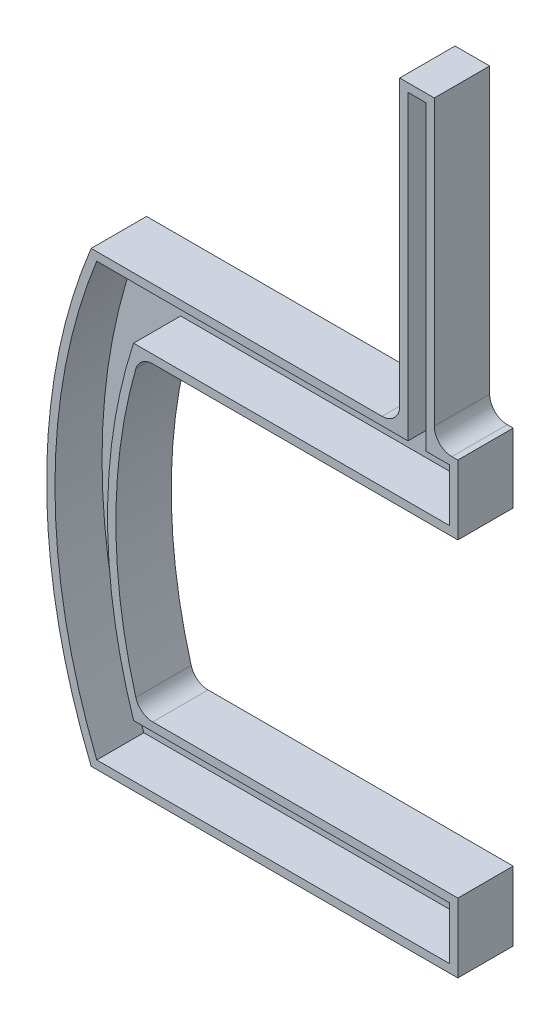
ISO-10303-21;
HEADER;
FILE_DESCRIPTION(('STEP AP214'),'2;1');
FILE_NAME('part.step','',(''),(''),'','','');
FILE_SCHEMA(('AUTOMOTIVE_DESIGN { 1 0 10303 214 1 1 1 1 }'));
ENDSEC;
DATA;
#1=APPLICATION_CONTEXT('core data for automotive mechanical design processes');
#2=APPLICATION_PROTOCOL_DEFINITION('international standard','automotive_design',2000,#1);
#3=PRODUCT_CONTEXT('',#1,'mechanical');
#4=PRODUCT('Part','Part','',(#3));
#5=PRODUCT_RELATED_PRODUCT_CATEGORY('part','',(#4));
#6=PRODUCT_DEFINITION_FORMATION('','',#4);
#7=PRODUCT_DEFINITION_CONTEXT('part definition',#1,'design');
#8=PRODUCT_DEFINITION('design','',#6,#7);
#9=PRODUCT_DEFINITION_SHAPE('','',#8);
#10=(LENGTH_UNIT() NAMED_UNIT(*) SI_UNIT(.MILLI.,.METRE.));
#11=(NAMED_UNIT(*) PLANE_ANGLE_UNIT() SI_UNIT($,.RADIAN.));
#12=(NAMED_UNIT(*) SI_UNIT($,.STERADIAN.) SOLID_ANGLE_UNIT());
#13=UNCERTAINTY_MEASURE_WITH_UNIT(LENGTH_MEASURE(1.E-05),#10,'distance_accuracy_value','');
#14=(GEOMETRIC_REPRESENTATION_CONTEXT(3) GLOBAL_UNCERTAINTY_ASSIGNED_CONTEXT((#13)) GLOBAL_UNIT_ASSIGNED_CONTEXT((#10,
#11,#12)) REPRESENTATION_CONTEXT('',''));
#15=CARTESIAN_POINT('',(0.,0.,0.));
#16=DIRECTION('',(0.,0.,1.));
#17=DIRECTION('',(1.,0.,0.));
#18=AXIS2_PLACEMENT_3D('',#15,#16,#17);
#19=CARTESIAN_POINT('',(-72.,81.,20.));
#20=DIRECTION('',(0.,-1.,0.));
#21=DIRECTION('',(0.,0.,-1.));
#22=AXIS2_PLACEMENT_3D('',#19,#20,#21);
#23=PLANE('',#22);
#24=DIRECTION('',(-1.,0.,0.));
#25=VECTOR('',#24,1.);
#26=CARTESIAN_POINT('',(-72.,81.,0.));
#27=LINE('',#26,#25);
#28=CARTESIAN_POINT('',(-63.5,81.,0.));
#29=VERTEX_POINT('',#28);
#30=CARTESIAN_POINT('',(-65.65,81.,0.));
#31=VERTEX_POINT('',#30);
#32=EDGE_CURVE('E294',#29,#31,#27,.T.);
#33=ORIENTED_EDGE('',*,*,#32,.T.);
#34=DIRECTION('',(0.,0.,-1.));
#35=VECTOR('',#34,1.);
#36=CARTESIAN_POINT('',(-65.65,81.,20.));
#37=LINE('',#36,#35);
#38=CARTESIAN_POINT('',(-65.65,81.,20.));
#39=VERTEX_POINT('',#38);
#40=EDGE_CURVE('E377',#31,#39,#37,.F.);
#41=ORIENTED_EDGE('',*,*,#40,.T.);
#42=DIRECTION('',(-1.,0.,0.));
#43=VECTOR('',#42,1.);
#44=CARTESIAN_POINT('',(-72.,81.,20.));
#45=LINE('',#44,#43);
#46=CARTESIAN_POINT('',(-63.5,81.,20.));
#47=VERTEX_POINT('',#46);
#48=EDGE_CURVE('E296',#47,#39,#45,.T.);
#49=ORIENTED_EDGE('',*,*,#48,.F.);
#50=DIRECTION('',(0.,0.,-1.));
#51=VECTOR('',#50,1.);
#52=CARTESIAN_POINT('',(-63.5,81.,20.));
#53=LINE('',#52,#51);
#54=EDGE_CURVE('E324',#47,#29,#53,.T.);
#55=ORIENTED_EDGE('',*,*,#54,.T.);
#56=EDGE_LOOP('',(#33,#41,#49,#55));
#57=FACE_BOUND('',#56,.T.);
#58=ADVANCED_FACE('F33',(#57),#23,.F.);
#59=CARTESIAN_POINT('',(-72.,190.,20.));
#60=DIRECTION('',(-1.,0.,0.));
#61=DIRECTION('',(0.,-1.,0.));
#62=AXIS2_PLACEMENT_3D('',#59,#60,#61);
#63=PLANE('',#62);
#64=DIRECTION('',(0.,1.,0.));
#65=VECTOR('',#64,1.);
#66=CARTESIAN_POINT('',(-72.,190.,20.));
#67=LINE('',#66,#65);
#68=CARTESIAN_POINT('',(-72.,87.35,20.));
#69=VERTEX_POINT('',#68);
#70=CARTESIAN_POINT('',(-72.,190.,20.));
#71=VERTEX_POINT('',#70);
#72=EDGE_CURVE('E299',#69,#71,#67,.T.);
#73=ORIENTED_EDGE('',*,*,#72,.F.);
#74=DIRECTION('',(0.,0.,-1.));
#75=VECTOR('',#74,1.);
#76=CARTESIAN_POINT('',(-72.,87.35,0.));
#77=LINE('',#76,#75);
#78=CARTESIAN_POINT('',(-72.,87.35,0.));
#79=VERTEX_POINT('',#78);
#80=EDGE_CURVE('E374',#69,#79,#77,.T.);
#81=ORIENTED_EDGE('',*,*,#80,.T.);
#82=DIRECTION('',(0.,1.,0.));
#83=VECTOR('',#82,1.);
#84=CARTESIAN_POINT('',(-72.,190.,0.));
#85=LINE('',#84,#83);
#86=CARTESIAN_POINT('',(-72.,190.,0.));
#87=VERTEX_POINT('',#86);
#88=EDGE_CURVE('E327',#79,#87,#85,.T.);
#89=ORIENTED_EDGE('',*,*,#88,.T.);
#90=DIRECTION('',(0.,0.,-1.));
#91=VECTOR('',#90,1.);
#92=CARTESIAN_POINT('',(-72.,190.,20.));
#93=LINE('',#92,#91);
#94=EDGE_CURVE('E371',#71,#87,#93,.T.);
#95=ORIENTED_EDGE('',*,*,#94,.F.);
#96=EDGE_LOOP('',(#73,#81,#89,#95));
#97=FACE_BOUND('',#96,.T.);
#98=ADVANCED_FACE('F431',(#97),#63,.F.);
#99=CARTESIAN_POINT('',(-84.5,190.,20.));
#100=DIRECTION('',(0.,-1.,0.));
#101=DIRECTION('',(0.,0.,-1.));
#102=AXIS2_PLACEMENT_3D('',#99,#100,#101);
#103=PLANE('',#102);
#104=DIRECTION('',(-1.,0.,0.));
#105=VECTOR('',#104,1.);
#106=CARTESIAN_POINT('',(-84.5,190.,0.));
#107=LINE('',#106,#105);
#108=CARTESIAN_POINT('',(-84.5,190.,0.));
#109=VERTEX_POINT('',#108);
#110=EDGE_CURVE('E329',#87,#109,#107,.T.);
#111=ORIENTED_EDGE('',*,*,#110,.T.);
#112=DIRECTION('',(0.,0.,-1.));
#113=VECTOR('',#112,1.);
#114=CARTESIAN_POINT('',(-84.5,190.,20.));
#115=LINE('',#114,#113);
#116=CARTESIAN_POINT('',(-84.5,190.,20.));
#117=VERTEX_POINT('',#116);
#118=EDGE_CURVE('E368',#117,#109,#115,.T.);
#119=ORIENTED_EDGE('',*,*,#118,.F.);
#120=DIRECTION('',(-1.,0.,0.));
#121=VECTOR('',#120,1.);
#122=CARTESIAN_POINT('',(-84.5,190.,20.));
#123=LINE('',#122,#121);
#124=EDGE_CURVE('E302',#71,#117,#123,.T.);
#125=ORIENTED_EDGE('',*,*,#124,.F.);
#126=ORIENTED_EDGE('',*,*,#94,.T.);
#127=EDGE_LOOP('',(#111,#119,#125,#126));
#128=FACE_BOUND('',#127,.T.);
#129=ADVANCED_FACE('F437',(#128),#103,.F.);
#130=CARTESIAN_POINT('',(-84.5,81.,20.));
#131=DIRECTION('',(1.,0.,0.));
#132=DIRECTION('',(0.,0.,-1.));
#133=AXIS2_PLACEMENT_3D('',#130,#131,#132);
#134=PLANE('',#133);
#135=DIRECTION('',(0.,-1.,0.));
#136=VECTOR('',#135,1.);
#137=CARTESIAN_POINT('',(-84.5,81.,0.));
#138=LINE('',#137,#136);
#139=CARTESIAN_POINT('',(-84.5,87.35,0.));
#140=VERTEX_POINT('',#139);
#141=EDGE_CURVE('E331',#109,#140,#138,.T.);
#142=ORIENTED_EDGE('',*,*,#141,.T.);
#143=DIRECTION('',(0.,0.,-1.));
#144=VECTOR('',#143,1.);
#145=CARTESIAN_POINT('',(-84.5,87.35,20.));
#146=LINE('',#145,#144);
#147=CARTESIAN_POINT('',(-84.5,87.35,20.));
#148=VERTEX_POINT('',#147);
#149=EDGE_CURVE('E382',#140,#148,#146,.F.);
#150=ORIENTED_EDGE('',*,*,#149,.T.);
#151=DIRECTION('',(0.,-1.,0.));
#152=VECTOR('',#151,1.);
#153=CARTESIAN_POINT('',(-84.5,81.,20.));
#154=LINE('',#153,#152);
#155=EDGE_CURVE('E304',#117,#148,#154,.T.);
#156=ORIENTED_EDGE('',*,*,#155,.F.);
#157=ORIENTED_EDGE('',*,*,#118,.T.);
#158=EDGE_LOOP('',(#142,#150,#156,#157));
#159=FACE_BOUND('',#158,.T.);
#160=ADVANCED_FACE('F563',(#159),#134,.F.);
#161=CARTESIAN_POINT('',(-195.915798239958,81.,20.));
#162=DIRECTION('',(0.,-1.,0.));
#163=DIRECTION('',(0.,0.,-1.));
#164=AXIS2_PLACEMENT_3D('',#161,#162,#163);
#165=PLANE('',#164);
#166=DIRECTION('',(-1.,0.,0.));
#167=VECTOR('',#166,1.);
#168=CARTESIAN_POINT('',(-195.915798239958,81.,20.));
#169=LINE('',#168,#167);
#170=CARTESIAN_POINT('',(-90.85,81.,20.));
#171=VERTEX_POINT('',#170);
#172=CARTESIAN_POINT('',(-195.915798239958,81.,20.));
#173=VERTEX_POINT('',#172);
#174=EDGE_CURVE('E307',#171,#173,#169,.T.);
#175=ORIENTED_EDGE('',*,*,#174,.F.);
#176=DIRECTION('',(0.,0.,-1.));
#177=VECTOR('',#176,1.);
#178=CARTESIAN_POINT('',(-90.85,81.,0.));
#179=LINE('',#178,#177);
#180=CARTESIAN_POINT('',(-90.85,81.,0.));
#181=VERTEX_POINT('',#180);
#182=EDGE_CURVE('E379',#171,#181,#179,.T.);
#183=ORIENTED_EDGE('',*,*,#182,.T.);
#184=DIRECTION('',(-1.,0.,0.));
#185=VECTOR('',#184,1.);
#186=CARTESIAN_POINT('',(-195.915798239958,81.,0.));
#187=LINE('',#186,#185);
#188=CARTESIAN_POINT('',(-195.915798239958,81.,0.));
#189=VERTEX_POINT('',#188);
#190=EDGE_CURVE('E334',#181,#189,#187,.T.);
#191=ORIENTED_EDGE('',*,*,#190,.T.);
#192=DIRECTION('',(0.,0.,-1.));
#193=VECTOR('',#192,1.);
#194=CARTESIAN_POINT('',(-195.915798239958,81.,20.));
#195=LINE('',#194,#193);
#196=EDGE_CURVE('E365',#173,#189,#195,.T.);
#197=ORIENTED_EDGE('',*,*,#196,.F.);
#198=EDGE_LOOP('',(#175,#183,#191,#197));
#199=FACE_BOUND('',#198,.T.);
#200=ADVANCED_FACE('F448',(#199),#165,.F.);
#201=CARTESIAN_POINT('',(0.,0.,20.));
#202=DIRECTION('',(0.,0.,-1.));
#203=DIRECTION('',(-1.,0.,0.));
#204=AXIS2_PLACEMENT_3D('',#201,#202,#203);
#205=CYLINDRICAL_SURFACE('',#204,212.);
#206=CARTESIAN_POINT('',(0.,0.,0.));
#207=DIRECTION('',(0.,0.,1.));
#208=DIRECTION('',(1.,0.,0.));
#209=AXIS2_PLACEMENT_3D('',#206,#207,#208);
#210=CIRCLE('',#209,212.);
#211=CARTESIAN_POINT('',(-195.915798239958,-81.,0.));
#212=VERTEX_POINT('',#211);
#213=EDGE_CURVE('E336',#189,#212,#210,.T.);
#214=ORIENTED_EDGE('',*,*,#213,.T.);
#215=DIRECTION('',(0.,0.,-1.));
#216=VECTOR('',#215,1.);
#217=CARTESIAN_POINT('',(-195.915798239958,-81.,20.));
#218=LINE('',#217,#216);
#219=CARTESIAN_POINT('',(-195.915798239958,-81.,20.));
#220=VERTEX_POINT('',#219);
#221=EDGE_CURVE('E362',#220,#212,#218,.T.);
#222=ORIENTED_EDGE('',*,*,#221,.F.);
#223=CARTESIAN_POINT('',(0.,0.,20.));
#224=DIRECTION('',(0.,0.,1.));
#225=DIRECTION('',(1.,0.,0.));
#226=AXIS2_PLACEMENT_3D('',#223,#224,#225);
#227=CIRCLE('',#226,212.);
#228=EDGE_CURVE('E309',#173,#220,#227,.T.);
#229=ORIENTED_EDGE('',*,*,#228,.F.);
#230=ORIENTED_EDGE('',*,*,#196,.T.);
#231=EDGE_LOOP('',(#214,#222,#229,#230));
#232=FACE_BOUND('',#231,.T.);
#233=ADVANCED_FACE('F456',(#232),#205,.T.);
#234=CARTESIAN_POINT('',(-195.915798239958,-81.,20.));
#235=DIRECTION('',(0.,1.,0.));
#236=DIRECTION('',(0.,0.,1.));
#237=AXIS2_PLACEMENT_3D('',#234,#235,#236);
#238=PLANE('',#237);
#239=DIRECTION('',(1.,0.,0.));
#240=VECTOR('',#239,1.);
#241=CARTESIAN_POINT('',(-195.915798239958,-81.,0.));
#242=LINE('',#241,#240);
#243=CARTESIAN_POINT('',(-63.5,-81.,0.));
#244=VERTEX_POINT('',#243);
#245=EDGE_CURVE('E338',#212,#244,#242,.T.);
#246=ORIENTED_EDGE('',*,*,#245,.T.);
#247=DIRECTION('',(0.,0.,-1.));
#248=VECTOR('',#247,1.);
#249=CARTESIAN_POINT('',(-63.5,-81.,20.));
#250=LINE('',#249,#248);
#251=CARTESIAN_POINT('',(-63.5,-81.,20.));
#252=VERTEX_POINT('',#251);
#253=EDGE_CURVE('E359',#252,#244,#250,.T.);
#254=ORIENTED_EDGE('',*,*,#253,.F.);
#255=DIRECTION('',(1.,0.,0.));
#256=VECTOR('',#255,1.);
#257=CARTESIAN_POINT('',(-195.915798239958,-81.,20.));
#258=LINE('',#257,#256);
#259=EDGE_CURVE('E311',#220,#252,#258,.T.);
#260=ORIENTED_EDGE('',*,*,#259,.F.);
#261=ORIENTED_EDGE('',*,*,#221,.T.);
#262=EDGE_LOOP('',(#246,#254,#260,#261));
#263=FACE_BOUND('',#262,.T.);
#264=ADVANCED_FACE('F460',(#263),#238,.F.);
#265=CARTESIAN_POINT('',(-63.5,-56.,20.));
#266=DIRECTION('',(-1.,0.,0.));
#267=DIRECTION('',(0.,0.,1.));
#268=AXIS2_PLACEMENT_3D('',#265,#266,#267);
#269=PLANE('',#268);
#270=DIRECTION('',(0.,1.,0.));
#271=VECTOR('',#270,1.);
#272=CARTESIAN_POINT('',(-63.5,-56.,0.));
#273=LINE('',#272,#271);
#274=CARTESIAN_POINT('',(-63.5,-56.,0.));
#275=VERTEX_POINT('',#274);
#276=EDGE_CURVE('E340',#244,#275,#273,.T.);
#277=ORIENTED_EDGE('',*,*,#276,.T.);
#278=DIRECTION('',(0.,0.,-1.));
#279=VECTOR('',#278,1.);
#280=CARTESIAN_POINT('',(-63.5,-56.,20.));
#281=LINE('',#280,#279);
#282=CARTESIAN_POINT('',(-63.5,-56.,20.));
#283=VERTEX_POINT('',#282);
#284=EDGE_CURVE('E356',#283,#275,#281,.T.);
#285=ORIENTED_EDGE('',*,*,#284,.F.);
#286=DIRECTION('',(0.,1.,0.));
#287=VECTOR('',#286,1.);
#288=CARTESIAN_POINT('',(-63.5,-56.,20.));
#289=LINE('',#288,#287);
#290=EDGE_CURVE('E313',#252,#283,#289,.T.);
#291=ORIENTED_EDGE('',*,*,#290,.F.);
#292=ORIENTED_EDGE('',*,*,#253,.T.);
#293=EDGE_LOOP('',(#277,#285,#291,#292));
#294=FACE_BOUND('',#293,.T.);
#295=ADVANCED_FACE('F467',(#294),#269,.F.);
#296=CARTESIAN_POINT('',(-63.5,-56.,20.));
#297=DIRECTION('',(0.,-1.,0.));
#298=DIRECTION('',(1.,0.,0.));
#299=AXIS2_PLACEMENT_3D('',#296,#297,#298);
#300=PLANE('',#299);
#301=DIRECTION('',(-1.,0.,0.));
#302=VECTOR('',#301,1.);
#303=CARTESIAN_POINT('',(-63.5,-56.,0.));
#304=LINE('',#303,#302);
#305=CARTESIAN_POINT('',(-173.693120186149,-56.,0.));
#306=VERTEX_POINT('',#305);
#307=EDGE_CURVE('E342',#275,#306,#304,.T.);
#308=ORIENTED_EDGE('',*,*,#307,.T.);
#309=DIRECTION('',(0.,0.,1.));
#310=VECTOR('',#309,1.);
#311=CARTESIAN_POINT('',(-173.693120186149,-56.,20.));
#312=LINE('',#311,#310);
#313=CARTESIAN_POINT('',(-173.693120186149,-56.,20.));
#314=VERTEX_POINT('',#313);
#315=EDGE_CURVE('E389',#306,#314,#312,.T.);
#316=ORIENTED_EDGE('',*,*,#315,.T.);
#317=DIRECTION('',(-1.,0.,0.));
#318=VECTOR('',#317,1.);
#319=CARTESIAN_POINT('',(-63.5,-56.,20.));
#320=LINE('',#319,#318);
#321=EDGE_CURVE('E315',#283,#314,#320,.T.);
#322=ORIENTED_EDGE('',*,*,#321,.F.);
#323=ORIENTED_EDGE('',*,*,#284,.T.);
#324=EDGE_LOOP('',(#308,#316,#322,#323));
#325=FACE_BOUND('',#324,.T.);
#326=ADVANCED_FACE('F470',(#325),#300,.F.);
#327=CARTESIAN_POINT('',(0.,0.,20.));
#328=DIRECTION('',(0.,0.,-1.));
#329=DIRECTION('',(-1.,0.,0.));
#330=AXIS2_PLACEMENT_3D('',#327,#328,#329);
#331=CYLINDRICAL_SURFACE('',#330,187.);
#332=CARTESIAN_POINT('',(0.,0.,20.));
#333=DIRECTION('',(0.,0.,-1.));
#334=DIRECTION('',(1.,0.,0.));
#335=AXIS2_PLACEMENT_3D('',#332,#333,#334);
#336=CIRCLE('',#335,187.);
#337=CARTESIAN_POINT('',(-179.798579987876,-51.39523941323,20.));
#338=VERTEX_POINT('',#337);
#339=CARTESIAN_POINT('',(-179.798579987876,51.39523941323,20.));
#340=VERTEX_POINT('',#339);
#341=EDGE_CURVE('E318',#338,#340,#336,.T.);
#342=ORIENTED_EDGE('',*,*,#341,.F.);
#343=DIRECTION('',(0.,0.,-1.));
#344=VECTOR('',#343,1.);
#345=CARTESIAN_POINT('',(-179.798579987876,-51.39523941323,20.));
#346=LINE('',#345,#344);
#347=CARTESIAN_POINT('',(-179.798579987876,-51.39523941323,0.));
#348=VERTEX_POINT('',#347);
#349=EDGE_CURVE('E386',#338,#348,#346,.T.);
#350=ORIENTED_EDGE('',*,*,#349,.T.);
#351=CARTESIAN_POINT('',(0.,0.,0.));
#352=DIRECTION('',(0.,0.,-1.));
#353=DIRECTION('',(1.,0.,0.));
#354=AXIS2_PLACEMENT_3D('',#351,#352,#353);
#355=CIRCLE('',#354,187.);
#356=CARTESIAN_POINT('',(-179.798579987876,51.39523941323,0.));
#357=VERTEX_POINT('',#356);
#358=EDGE_CURVE('E345',#348,#357,#355,.T.);
#359=ORIENTED_EDGE('',*,*,#358,.T.);
#360=DIRECTION('',(0.,0.,-1.));
#361=VECTOR('',#360,1.);
#362=CARTESIAN_POINT('',(-179.798579987876,51.39523941323,20.));
#363=LINE('',#362,#361);
#364=EDGE_CURVE('E384',#357,#340,#363,.F.);
#365=ORIENTED_EDGE('',*,*,#364,.T.);
#366=EDGE_LOOP('',(#342,#350,#359,#365));
#367=FACE_BOUND('',#366,.T.);
#368=ADVANCED_FACE('F412',(#367),#331,.F.);
#369=CARTESIAN_POINT('',(-63.5,56.,20.));
#370=DIRECTION('',(0.,1.,0.));
#371=DIRECTION('',(-1.,0.,0.));
#372=AXIS2_PLACEMENT_3D('',#369,#370,#371);
#373=PLANE('',#372);
#374=DIRECTION('',(1.,0.,0.));
#375=VECTOR('',#374,1.);
#376=CARTESIAN_POINT('',(-63.5,56.,20.));
#377=LINE('',#376,#375);
#378=CARTESIAN_POINT('',(-173.693120186149,56.,20.));
#379=VERTEX_POINT('',#378);
#380=CARTESIAN_POINT('',(-63.5,56.,20.));
#381=VERTEX_POINT('',#380);
#382=EDGE_CURVE('E320',#379,#381,#377,.T.);
#383=ORIENTED_EDGE('',*,*,#382,.F.);
#384=DIRECTION('',(0.,0.,1.));
#385=VECTOR('',#384,1.);
#386=CARTESIAN_POINT('',(-173.693120186149,56.,0.));
#387=LINE('',#386,#385);
#388=CARTESIAN_POINT('',(-173.693120186149,56.,0.));
#389=VERTEX_POINT('',#388);
#390=EDGE_CURVE('E391',#379,#389,#387,.F.);
#391=ORIENTED_EDGE('',*,*,#390,.T.);
#392=DIRECTION('',(1.,0.,0.));
#393=VECTOR('',#392,1.);
#394=CARTESIAN_POINT('',(-63.5,56.,0.));
#395=LINE('',#394,#393);
#396=CARTESIAN_POINT('',(-63.5,56.,0.));
#397=VERTEX_POINT('',#396);
#398=EDGE_CURVE('E348',#389,#397,#395,.T.);
#399=ORIENTED_EDGE('',*,*,#398,.T.);
#400=DIRECTION('',(0.,0.,-1.));
#401=VECTOR('',#400,1.);
#402=CARTESIAN_POINT('',(-63.5,56.,20.));
#403=LINE('',#402,#401);
#404=EDGE_CURVE('E353',#381,#397,#403,.T.);
#405=ORIENTED_EDGE('',*,*,#404,.F.);
#406=EDGE_LOOP('',(#383,#391,#399,#405));
#407=FACE_BOUND('',#406,.T.);
#408=ADVANCED_FACE('F415',(#407),#373,.F.);
#409=CARTESIAN_POINT('',(-63.5,81.,20.));
#410=DIRECTION('',(-1.,0.,0.));
#411=DIRECTION('',(0.,0.,1.));
#412=AXIS2_PLACEMENT_3D('',#409,#410,#411);
#413=PLANE('',#412);
#414=DIRECTION('',(0.,1.,0.));
#415=VECTOR('',#414,1.);
#416=CARTESIAN_POINT('',(-63.5,81.,0.));
#417=LINE('',#416,#415);
#418=EDGE_CURVE('E300',#397,#29,#417,.T.);
#419=ORIENTED_EDGE('',*,*,#418,.T.);
#420=ORIENTED_EDGE('',*,*,#54,.F.);
#421=DIRECTION('',(0.,1.,0.));
#422=VECTOR('',#421,1.);
#423=CARTESIAN_POINT('',(-63.5,81.,20.));
#424=LINE('',#423,#422);
#425=EDGE_CURVE('E322',#381,#47,#424,.T.);
#426=ORIENTED_EDGE('',*,*,#425,.F.);
#427=ORIENTED_EDGE('',*,*,#404,.T.);
#428=EDGE_LOOP('',(#419,#420,#426,#427));
#429=FACE_BOUND('',#428,.T.);
#430=ADVANCED_FACE('F422',(#429),#413,.F.);
#431=CARTESIAN_POINT('',(0.,0.,20.));
#432=DIRECTION('',(0.,0.,1.));
#433=DIRECTION('',(1.,0.,0.));
#434=AXIS2_PLACEMENT_3D('',#431,#432,#433);
#435=PLANE('',#434);
#436=DIRECTION('',(0.,1.,0.));
#437=VECTOR('',#436,1.);
#438=CARTESIAN_POINT('',(-66.5,59.,20.));
#439=LINE('',#438,#437);
#440=CARTESIAN_POINT('',(-66.5,59.,20.));
#441=VERTEX_POINT('',#440);
#442=CARTESIAN_POINT('',(-66.5,78.,20.));
#443=VERTEX_POINT('',#442);
#444=EDGE_CURVE('E238',#441,#443,#439,.T.);
#445=ORIENTED_EDGE('',*,*,#444,.F.);
#446=DIRECTION('',(1.,0.,0.));
#447=VECTOR('',#446,1.);
#448=CARTESIAN_POINT('',(-180.607308822207,59.,20.));
#449=LINE('',#448,#447);
#450=CARTESIAN_POINT('',(-180.607308822207,59.,20.));
#451=VERTEX_POINT('',#450);
#452=EDGE_CURVE('E269',#451,#441,#449,.T.);
#453=ORIENTED_EDGE('',*,*,#452,.F.);
#454=CARTESIAN_POINT('',(0.,0.,20.));
#455=DIRECTION('',(0.,0.,-1.));
#456=DIRECTION('',(1.,0.,0.));
#457=AXIS2_PLACEMENT_3D('',#454,#455,#456);
#458=CIRCLE('',#457,190.);
#459=CARTESIAN_POINT('',(-180.607308822207,-59.,20.));
#460=VERTEX_POINT('',#459);
#461=EDGE_CURVE('E266',#460,#451,#458,.T.);
#462=ORIENTED_EDGE('',*,*,#461,.F.);
#463=DIRECTION('',(-1.,0.,0.));
#464=VECTOR('',#463,1.);
#465=CARTESIAN_POINT('',(-66.5,-59.,20.));
#466=LINE('',#465,#464);
#467=CARTESIAN_POINT('',(-66.5,-59.,20.));
#468=VERTEX_POINT('',#467);
#469=EDGE_CURVE('E263',#468,#460,#466,.T.);
#470=ORIENTED_EDGE('',*,*,#469,.F.);
#471=DIRECTION('',(0.,1.,0.));
#472=VECTOR('',#471,1.);
#473=CARTESIAN_POINT('',(-66.5,-78.,20.));
#474=LINE('',#473,#472);
#475=CARTESIAN_POINT('',(-66.5,-78.,20.));
#476=VERTEX_POINT('',#475);
#477=EDGE_CURVE('E260',#476,#468,#474,.T.);
#478=ORIENTED_EDGE('',*,*,#477,.F.);
#479=DIRECTION('',(1.,0.,0.));
#480=VECTOR('',#479,1.);
#481=CARTESIAN_POINT('',(-193.899458482998,-78.,20.));
#482=LINE('',#481,#480);
#483=CARTESIAN_POINT('',(-193.899458482998,-77.9999999999999,20.));
#484=VERTEX_POINT('',#483);
#485=EDGE_CURVE('E257',#484,#476,#482,.T.);
#486=ORIENTED_EDGE('',*,*,#485,.F.);
#487=CARTESIAN_POINT('',(0.,0.,20.));
#488=DIRECTION('',(0.,0.,1.));
#489=DIRECTION('',(1.,0.,0.));
#490=AXIS2_PLACEMENT_3D('',#487,#488,#489);
#491=CIRCLE('',#490,209.);
#492=CARTESIAN_POINT('',(-193.899458482998,78.,20.));
#493=VERTEX_POINT('',#492);
#494=EDGE_CURVE('E254',#493,#484,#491,.T.);
#495=ORIENTED_EDGE('',*,*,#494,.F.);
#496=DIRECTION('',(-1.,0.,0.));
#497=VECTOR('',#496,1.);
#498=CARTESIAN_POINT('',(-81.5,78.,20.));
#499=LINE('',#498,#497);
#500=CARTESIAN_POINT('',(-81.5,78.,20.));
#501=VERTEX_POINT('',#500);
#502=EDGE_CURVE('E251',#501,#493,#499,.T.);
#503=ORIENTED_EDGE('',*,*,#502,.F.);
#504=DIRECTION('',(0.,-1.,0.));
#505=VECTOR('',#504,1.);
#506=CARTESIAN_POINT('',(-81.5,187.,20.));
#507=LINE('',#506,#505);
#508=CARTESIAN_POINT('',(-81.5,187.,20.));
#509=VERTEX_POINT('',#508);
#510=EDGE_CURVE('E245',#509,#501,#507,.T.);
#511=ORIENTED_EDGE('',*,*,#510,.F.);
#512=DIRECTION('',(-1.,0.,0.));
#513=VECTOR('',#512,1.);
#514=CARTESIAN_POINT('',(-75.,187.,20.));
#515=LINE('',#514,#513);
#516=CARTESIAN_POINT('',(-75.,187.,20.));
#517=VERTEX_POINT('',#516);
#518=EDGE_CURVE('E243',#517,#509,#515,.T.);
#519=ORIENTED_EDGE('',*,*,#518,.F.);
#520=DIRECTION('',(0.,1.,0.));
#521=VECTOR('',#520,1.);
#522=CARTESIAN_POINT('',(-75.,78.,20.));
#523=LINE('',#522,#521);
#524=CARTESIAN_POINT('',(-75.,78.,20.));
#525=VERTEX_POINT('',#524);
#526=EDGE_CURVE('E222',#525,#517,#523,.T.);
#527=ORIENTED_EDGE('',*,*,#526,.F.);
#528=DIRECTION('',(-1.,0.,0.));
#529=VECTOR('',#528,1.);
#530=CARTESIAN_POINT('',(-66.5,78.,20.));
#531=LINE('',#530,#529);
#532=EDGE_CURVE('E233',#443,#525,#531,.T.);
#533=ORIENTED_EDGE('',*,*,#532,.F.);
#534=EDGE_LOOP('',(#445,#453,#462,#470,#478,#486,#495,#503,#511,#519,#527,#533));
#535=FACE_BOUND('',#534,.T.);
#536=ORIENTED_EDGE('',*,*,#48,.T.);
#537=CARTESIAN_POINT('',(-65.65,87.35,20.));
#538=DIRECTION('',(0.,0.,1.));
#539=DIRECTION('',(1.,0.,0.));
#540=AXIS2_PLACEMENT_3D('',#537,#538,#539);
#541=CIRCLE('',#540,6.35);
#542=EDGE_CURVE('E395',#39,#69,#541,.F.);
#543=ORIENTED_EDGE('',*,*,#542,.T.);
#544=ORIENTED_EDGE('',*,*,#72,.T.);
#545=ORIENTED_EDGE('',*,*,#124,.T.);
#546=ORIENTED_EDGE('',*,*,#155,.T.);
#547=CARTESIAN_POINT('',(-90.85,87.35,20.));
#548=DIRECTION('',(0.,0.,1.));
#549=DIRECTION('',(1.,0.,0.));
#550=AXIS2_PLACEMENT_3D('',#547,#548,#549);
#551=CIRCLE('',#550,6.35);
#552=EDGE_CURVE('E399',#148,#171,#551,.F.);
#553=ORIENTED_EDGE('',*,*,#552,.T.);
#554=ORIENTED_EDGE('',*,*,#174,.T.);
#555=ORIENTED_EDGE('',*,*,#228,.T.);
#556=ORIENTED_EDGE('',*,*,#259,.T.);
#557=ORIENTED_EDGE('',*,*,#290,.T.);
#558=ORIENTED_EDGE('',*,*,#321,.T.);
#559=CARTESIAN_POINT('',(-173.693120186149,-49.65,20.));
#560=DIRECTION('',(0.,0.,1.));
#561=DIRECTION('',(1.,0.,0.));
#562=AXIS2_PLACEMENT_3D('',#559,#560,#561);
#563=CIRCLE('',#562,6.35);
#564=EDGE_CURVE('E403',#314,#338,#563,.F.);
#565=ORIENTED_EDGE('',*,*,#564,.T.);
#566=ORIENTED_EDGE('',*,*,#341,.T.);
#567=CARTESIAN_POINT('',(-173.693120186149,49.65,20.));
#568=DIRECTION('',(0.,0.,1.));
#569=DIRECTION('',(1.,0.,0.));
#570=AXIS2_PLACEMENT_3D('',#567,#568,#569);
#571=CIRCLE('',#570,6.35);
#572=EDGE_CURVE('E12',#340,#379,#571,.F.);
#573=ORIENTED_EDGE('',*,*,#572,.T.);
#574=ORIENTED_EDGE('',*,*,#382,.T.);
#575=ORIENTED_EDGE('',*,*,#425,.T.);
#576=EDGE_LOOP('',(#536,#543,#544,#545,#546,#553,#554,#555,#556,#557,#558,#565,#566,#573,#574,#575));
#577=FACE_BOUND('',#576,.T.);
#578=ADVANCED_FACE('F240',(#535,#577),#435,.T.);
#579=CARTESIAN_POINT('',(0.,0.,0.));
#580=DIRECTION('',(0.,0.,1.));
#581=DIRECTION('',(1.,0.,0.));
#582=AXIS2_PLACEMENT_3D('',#579,#580,#581);
#583=PLANE('',#582);
#584=ORIENTED_EDGE('',*,*,#32,.F.);
#585=ORIENTED_EDGE('',*,*,#418,.F.);
#586=ORIENTED_EDGE('',*,*,#398,.F.);
#587=CARTESIAN_POINT('',(-173.693120186149,49.65,0.));
#588=DIRECTION('',(0.,0.,1.));
#589=DIRECTION('',(1.,0.,0.));
#590=AXIS2_PLACEMENT_3D('',#587,#588,#589);
#591=CIRCLE('',#590,6.35);
#592=EDGE_CURVE('E41',#389,#357,#591,.T.);
#593=ORIENTED_EDGE('',*,*,#592,.T.);
#594=ORIENTED_EDGE('',*,*,#358,.F.);
#595=CARTESIAN_POINT('',(-173.693120186149,-49.65,0.));
#596=DIRECTION('',(0.,0.,1.));
#597=DIRECTION('',(1.,0.,0.));
#598=AXIS2_PLACEMENT_3D('',#595,#596,#597);
#599=CIRCLE('',#598,6.35);
#600=EDGE_CURVE('E401',#348,#306,#599,.T.);
#601=ORIENTED_EDGE('',*,*,#600,.T.);
#602=ORIENTED_EDGE('',*,*,#307,.F.);
#603=ORIENTED_EDGE('',*,*,#276,.F.);
#604=ORIENTED_EDGE('',*,*,#245,.F.);
#605=ORIENTED_EDGE('',*,*,#213,.F.);
#606=ORIENTED_EDGE('',*,*,#190,.F.);
#607=CARTESIAN_POINT('',(-90.85,87.35,0.));
#608=DIRECTION('',(0.,0.,1.));
#609=DIRECTION('',(1.,0.,0.));
#610=AXIS2_PLACEMENT_3D('',#607,#608,#609);
#611=CIRCLE('',#610,6.35);
#612=EDGE_CURVE('E397',#181,#140,#611,.T.);
#613=ORIENTED_EDGE('',*,*,#612,.T.);
#614=ORIENTED_EDGE('',*,*,#141,.F.);
#615=ORIENTED_EDGE('',*,*,#110,.F.);
#616=ORIENTED_EDGE('',*,*,#88,.F.);
#617=CARTESIAN_POINT('',(-65.65,87.35,0.));
#618=DIRECTION('',(0.,0.,1.));
#619=DIRECTION('',(1.,0.,0.));
#620=AXIS2_PLACEMENT_3D('',#617,#618,#619);
#621=CIRCLE('',#620,6.35);
#622=EDGE_CURVE('E393',#79,#31,#621,.T.);
#623=ORIENTED_EDGE('',*,*,#622,.T.);
#624=EDGE_LOOP('',(#584,#585,#586,#593,#594,#601,#602,#603,#604,#605,#606,#613,#614,#615,#616,#623));
#625=FACE_BOUND('',#624,.T.);
#626=ADVANCED_FACE('F408',(#625),#583,.F.);
#627=CARTESIAN_POINT('',(-66.5,59.,-300.88411390434));
#628=DIRECTION('',(1.,0.,0.));
#629=DIRECTION('',(0.,0.,-1.));
#630=AXIS2_PLACEMENT_3D('',#627,#628,#629);
#631=PLANE('',#630);
#632=DIRECTION('',(0.,-1.,0.));
#633=VECTOR('',#632,1.);
#634=CARTESIAN_POINT('',(-66.5,59.,3.));
#635=LINE('',#634,#633);
#636=CARTESIAN_POINT('',(-66.5,78.,3.));
#637=VERTEX_POINT('',#636);
#638=CARTESIAN_POINT('',(-66.5,59.,3.));
#639=VERTEX_POINT('',#638);
#640=EDGE_CURVE('E295',#637,#639,#635,.T.);
#641=ORIENTED_EDGE('',*,*,#640,.T.);
#642=DIRECTION('',(0.,0.,1.));
#643=VECTOR('',#642,1.);
#644=CARTESIAN_POINT('',(-66.5,59.,-300.88411390434));
#645=LINE('',#644,#643);
#646=EDGE_CURVE('E272',#639,#441,#645,.T.);
#647=ORIENTED_EDGE('',*,*,#646,.T.);
#648=ORIENTED_EDGE('',*,*,#444,.T.);
#649=DIRECTION('',(0.,0.,1.));
#650=VECTOR('',#649,1.);
#651=CARTESIAN_POINT('',(-66.5,78.,-300.88411390434));
#652=LINE('',#651,#650);
#653=EDGE_CURVE('E229',#637,#443,#652,.T.);
#654=ORIENTED_EDGE('',*,*,#653,.F.);
#655=EDGE_LOOP('',(#641,#647,#648,#654));
#656=FACE_BOUND('',#655,.T.);
#657=ADVANCED_FACE('F505',(#656),#631,.F.);
#658=CARTESIAN_POINT('',(-180.607308822207,59.,-300.88411390434));
#659=DIRECTION('',(0.,-1.,0.));
#660=DIRECTION('',(1.,0.,0.));
#661=AXIS2_PLACEMENT_3D('',#658,#659,#660);
#662=PLANE('',#661);
#663=DIRECTION('',(-1.,0.,0.));
#664=VECTOR('',#663,1.);
#665=CARTESIAN_POINT('',(-180.607308822207,59.,3.));
#666=LINE('',#665,#664);
#667=CARTESIAN_POINT('',(-180.607308822207,59.,3.));
#668=VERTEX_POINT('',#667);
#669=EDGE_CURVE('E746',#639,#668,#666,.T.);
#670=ORIENTED_EDGE('',*,*,#669,.T.);
#671=DIRECTION('',(0.,0.,1.));
#672=VECTOR('',#671,1.);
#673=CARTESIAN_POINT('',(-180.607308822207,59.,-300.88411390434));
#674=LINE('',#673,#672);
#675=EDGE_CURVE('E274',#668,#451,#674,.T.);
#676=ORIENTED_EDGE('',*,*,#675,.T.);
#677=ORIENTED_EDGE('',*,*,#452,.T.);
#678=ORIENTED_EDGE('',*,*,#646,.F.);
#679=EDGE_LOOP('',(#670,#676,#677,#678));
#680=FACE_BOUND('',#679,.T.);
#681=ADVANCED_FACE('F501',(#680),#662,.F.);
#682=CARTESIAN_POINT('',(0.,0.,-300.88411390434));
#683=DIRECTION('',(0.,0.,1.));
#684=DIRECTION('',(1.,0.,0.));
#685=AXIS2_PLACEMENT_3D('',#682,#683,#684);
#686=CYLINDRICAL_SURFACE('',#685,190.);
#687=CARTESIAN_POINT('',(0.,0.,3.));
#688=DIRECTION('',(0.,0.,1.));
#689=DIRECTION('',(1.,0.,0.));
#690=AXIS2_PLACEMENT_3D('',#687,#688,#689);
#691=CIRCLE('',#690,190.);
#692=CARTESIAN_POINT('',(-180.607308822207,-59.,3.));
#693=VERTEX_POINT('',#692);
#694=EDGE_CURVE('E750',#668,#693,#691,.T.);
#695=ORIENTED_EDGE('',*,*,#694,.T.);
#696=DIRECTION('',(0.,0.,1.));
#697=VECTOR('',#696,1.);
#698=CARTESIAN_POINT('',(-180.607308822207,-59.,-300.88411390434));
#699=LINE('',#698,#697);
#700=EDGE_CURVE('E276',#693,#460,#699,.T.);
#701=ORIENTED_EDGE('',*,*,#700,.T.);
#702=ORIENTED_EDGE('',*,*,#461,.T.);
#703=ORIENTED_EDGE('',*,*,#675,.F.);
#704=EDGE_LOOP('',(#695,#701,#702,#703));
#705=FACE_BOUND('',#704,.T.);
#706=ADVANCED_FACE('F504',(#705),#686,.T.);
#707=CARTESIAN_POINT('',(-66.5,-59.,-300.88411390434));
#708=DIRECTION('',(0.,1.,0.));
#709=DIRECTION('',(-1.,0.,0.));
#710=AXIS2_PLACEMENT_3D('',#707,#708,#709);
#711=PLANE('',#710);
#712=DIRECTION('',(1.,0.,0.));
#713=VECTOR('',#712,1.);
#714=CARTESIAN_POINT('',(-66.5,-59.,3.));
#715=LINE('',#714,#713);
#716=CARTESIAN_POINT('',(-66.5,-59.,3.));
#717=VERTEX_POINT('',#716);
#718=EDGE_CURVE('E757',#693,#717,#715,.T.);
#719=ORIENTED_EDGE('',*,*,#718,.T.);
#720=DIRECTION('',(0.,0.,1.));
#721=VECTOR('',#720,1.);
#722=CARTESIAN_POINT('',(-66.5,-59.,-300.88411390434));
#723=LINE('',#722,#721);
#724=EDGE_CURVE('E278',#717,#468,#723,.T.);
#725=ORIENTED_EDGE('',*,*,#724,.T.);
#726=ORIENTED_EDGE('',*,*,#469,.T.);
#727=ORIENTED_EDGE('',*,*,#700,.F.);
#728=EDGE_LOOP('',(#719,#725,#726,#727));
#729=FACE_BOUND('',#728,.T.);
#730=ADVANCED_FACE('F509',(#729),#711,.F.);
#731=CARTESIAN_POINT('',(-66.5,-78.,-300.88411390434));
#732=DIRECTION('',(1.,0.,0.));
#733=DIRECTION('',(0.,0.,-1.));
#734=AXIS2_PLACEMENT_3D('',#731,#732,#733);
#735=PLANE('',#734);
#736=DIRECTION('',(0.,-1.,0.));
#737=VECTOR('',#736,1.);
#738=CARTESIAN_POINT('',(-66.5,-78.,3.));
#739=LINE('',#738,#737);
#740=CARTESIAN_POINT('',(-66.5,-78.,3.));
#741=VERTEX_POINT('',#740);
#742=EDGE_CURVE('E759',#717,#741,#739,.T.);
#743=ORIENTED_EDGE('',*,*,#742,.T.);
#744=DIRECTION('',(0.,0.,1.));
#745=VECTOR('',#744,1.);
#746=CARTESIAN_POINT('',(-66.5,-78.,-300.88411390434));
#747=LINE('',#746,#745);
#748=EDGE_CURVE('E280',#741,#476,#747,.T.);
#749=ORIENTED_EDGE('',*,*,#748,.T.);
#750=ORIENTED_EDGE('',*,*,#477,.T.);
#751=ORIENTED_EDGE('',*,*,#724,.F.);
#752=EDGE_LOOP('',(#743,#749,#750,#751));
#753=FACE_BOUND('',#752,.T.);
#754=ADVANCED_FACE('F513',(#753),#735,.F.);
#755=CARTESIAN_POINT('',(-193.899458482998,-78.,-300.88411390434));
#756=DIRECTION('',(0.,-1.,0.));
#757=DIRECTION('',(1.,0.,0.));
#758=AXIS2_PLACEMENT_3D('',#755,#756,#757);
#759=PLANE('',#758);
#760=DIRECTION('',(-1.,0.,0.));
#761=VECTOR('',#760,1.);
#762=CARTESIAN_POINT('',(-193.899458482998,-78.,3.));
#763=LINE('',#762,#761);
#764=CARTESIAN_POINT('',(-193.899458482998,-77.9999999999999,3.));
#765=VERTEX_POINT('',#764);
#766=EDGE_CURVE('E761',#741,#765,#763,.T.);
#767=ORIENTED_EDGE('',*,*,#766,.T.);
#768=DIRECTION('',(0.,0.,1.));
#769=VECTOR('',#768,1.);
#770=CARTESIAN_POINT('',(-193.899458482998,-77.9999999999999,-300.88411390434));
#771=LINE('',#770,#769);
#772=EDGE_CURVE('E282',#765,#484,#771,.T.);
#773=ORIENTED_EDGE('',*,*,#772,.T.);
#774=ORIENTED_EDGE('',*,*,#485,.T.);
#775=ORIENTED_EDGE('',*,*,#748,.F.);
#776=EDGE_LOOP('',(#767,#773,#774,#775));
#777=FACE_BOUND('',#776,.T.);
#778=ADVANCED_FACE('F517',(#777),#759,.F.);
#779=CARTESIAN_POINT('',(0.,0.,-300.88411390434));
#780=DIRECTION('',(0.,0.,1.));
#781=DIRECTION('',(1.,0.,0.));
#782=AXIS2_PLACEMENT_3D('',#779,#780,#781);
#783=CYLINDRICAL_SURFACE('',#782,209.);
#784=CARTESIAN_POINT('',(0.,0.,3.));
#785=DIRECTION('',(0.,0.,1.));
#786=DIRECTION('',(1.,0.,0.));
#787=AXIS2_PLACEMENT_3D('',#784,#785,#786);
#788=CIRCLE('',#787,209.);
#789=CARTESIAN_POINT('',(-193.899458482998,78.,3.));
#790=VERTEX_POINT('',#789);
#791=EDGE_CURVE('E763',#765,#790,#788,.F.);
#792=ORIENTED_EDGE('',*,*,#791,.T.);
#793=DIRECTION('',(0.,0.,1.));
#794=VECTOR('',#793,1.);
#795=CARTESIAN_POINT('',(-193.899458482998,78.,-300.88411390434));
#796=LINE('',#795,#794);
#797=EDGE_CURVE('E284',#790,#493,#796,.T.);
#798=ORIENTED_EDGE('',*,*,#797,.T.);
#799=ORIENTED_EDGE('',*,*,#494,.T.);
#800=ORIENTED_EDGE('',*,*,#772,.F.);
#801=EDGE_LOOP('',(#792,#798,#799,#800));
#802=FACE_BOUND('',#801,.T.);
#803=ADVANCED_FACE('F521',(#802),#783,.F.);
#804=CARTESIAN_POINT('',(-81.5,78.,-300.88411390434));
#805=DIRECTION('',(0.,1.,0.));
#806=DIRECTION('',(0.,0.,1.));
#807=AXIS2_PLACEMENT_3D('',#804,#805,#806);
#808=PLANE('',#807);
#809=DIRECTION('',(1.,0.,0.));
#810=VECTOR('',#809,1.);
#811=CARTESIAN_POINT('',(-81.5,78.,3.));
#812=LINE('',#811,#810);
#813=CARTESIAN_POINT('',(-81.5,78.,3.));
#814=VERTEX_POINT('',#813);
#815=EDGE_CURVE('E765',#790,#814,#812,.T.);
#816=ORIENTED_EDGE('',*,*,#815,.T.);
#817=DIRECTION('',(0.,0.,1.));
#818=VECTOR('',#817,1.);
#819=CARTESIAN_POINT('',(-81.5,78.,-300.88411390434));
#820=LINE('',#819,#818);
#821=EDGE_CURVE('E286',#814,#501,#820,.T.);
#822=ORIENTED_EDGE('',*,*,#821,.T.);
#823=ORIENTED_EDGE('',*,*,#502,.T.);
#824=ORIENTED_EDGE('',*,*,#797,.F.);
#825=EDGE_LOOP('',(#816,#822,#823,#824));
#826=FACE_BOUND('',#825,.T.);
#827=ADVANCED_FACE('F525',(#826),#808,.F.);
#828=CARTESIAN_POINT('',(-81.5,187.,-300.88411390434));
#829=DIRECTION('',(-1.,0.,0.));
#830=DIRECTION('',(0.,0.,1.));
#831=AXIS2_PLACEMENT_3D('',#828,#829,#830);
#832=PLANE('',#831);
#833=DIRECTION('',(0.,1.,0.));
#834=VECTOR('',#833,1.);
#835=CARTESIAN_POINT('',(-81.5,187.,3.));
#836=LINE('',#835,#834);
#837=CARTESIAN_POINT('',(-81.5,187.,3.));
#838=VERTEX_POINT('',#837);
#839=EDGE_CURVE('E767',#814,#838,#836,.T.);
#840=ORIENTED_EDGE('',*,*,#839,.T.);
#841=DIRECTION('',(0.,0.,1.));
#842=VECTOR('',#841,1.);
#843=CARTESIAN_POINT('',(-81.5,187.,-300.88411390434));
#844=LINE('',#843,#842);
#845=EDGE_CURVE('E288',#838,#509,#844,.T.);
#846=ORIENTED_EDGE('',*,*,#845,.T.);
#847=ORIENTED_EDGE('',*,*,#510,.T.);
#848=ORIENTED_EDGE('',*,*,#821,.F.);
#849=EDGE_LOOP('',(#840,#846,#847,#848));
#850=FACE_BOUND('',#849,.T.);
#851=ADVANCED_FACE('F529',(#850),#832,.F.);
#852=CARTESIAN_POINT('',(-75.,187.,-300.88411390434));
#853=DIRECTION('',(0.,1.,0.));
#854=DIRECTION('',(0.,0.,1.));
#855=AXIS2_PLACEMENT_3D('',#852,#853,#854);
#856=PLANE('',#855);
#857=DIRECTION('',(1.,0.,0.));
#858=VECTOR('',#857,1.);
#859=CARTESIAN_POINT('',(-75.,187.,3.));
#860=LINE('',#859,#858);
#861=CARTESIAN_POINT('',(-75.,187.,3.));
#862=VERTEX_POINT('',#861);
#863=EDGE_CURVE('E769',#838,#862,#860,.T.);
#864=ORIENTED_EDGE('',*,*,#863,.T.);
#865=DIRECTION('',(0.,0.,1.));
#866=VECTOR('',#865,1.);
#867=CARTESIAN_POINT('',(-75.,187.,-300.88411390434));
#868=LINE('',#867,#866);
#869=EDGE_CURVE('E228',#862,#517,#868,.T.);
#870=ORIENTED_EDGE('',*,*,#869,.T.);
#871=ORIENTED_EDGE('',*,*,#518,.T.);
#872=ORIENTED_EDGE('',*,*,#845,.F.);
#873=EDGE_LOOP('',(#864,#870,#871,#872));
#874=FACE_BOUND('',#873,.T.);
#875=ADVANCED_FACE('F533',(#874),#856,.F.);
#876=CARTESIAN_POINT('',(-75.,78.,-300.88411390434));
#877=DIRECTION('',(1.,0.,0.));
#878=DIRECTION('',(0.,1.,0.));
#879=AXIS2_PLACEMENT_3D('',#876,#877,#878);
#880=PLANE('',#879);
#881=DIRECTION('',(0.,-1.,0.));
#882=VECTOR('',#881,1.);
#883=CARTESIAN_POINT('',(-75.,78.,3.));
#884=LINE('',#883,#882);
#885=CARTESIAN_POINT('',(-75.,78.,3.));
#886=VERTEX_POINT('',#885);
#887=EDGE_CURVE('E225',#862,#886,#884,.T.);
#888=ORIENTED_EDGE('',*,*,#887,.T.);
#889=DIRECTION('',(0.,0.,1.));
#890=VECTOR('',#889,1.);
#891=CARTESIAN_POINT('',(-75.,78.,-300.88411390434));
#892=LINE('',#891,#890);
#893=EDGE_CURVE('E217',#886,#525,#892,.T.);
#894=ORIENTED_EDGE('',*,*,#893,.T.);
#895=ORIENTED_EDGE('',*,*,#526,.T.);
#896=ORIENTED_EDGE('',*,*,#869,.F.);
#897=EDGE_LOOP('',(#888,#894,#895,#896));
#898=FACE_BOUND('',#897,.T.);
#899=ADVANCED_FACE('F219',(#898),#880,.F.);
#900=CARTESIAN_POINT('',(-66.5,78.,-300.88411390434));
#901=DIRECTION('',(0.,1.,0.));
#902=DIRECTION('',(0.,0.,1.));
#903=AXIS2_PLACEMENT_3D('',#900,#901,#902);
#904=PLANE('',#903);
#905=DIRECTION('',(1.,0.,0.));
#906=VECTOR('',#905,1.);
#907=CARTESIAN_POINT('',(-66.5,78.,3.));
#908=LINE('',#907,#906);
#909=EDGE_CURVE('E292',#886,#637,#908,.T.);
#910=ORIENTED_EDGE('',*,*,#909,.T.);
#911=ORIENTED_EDGE('',*,*,#653,.T.);
#912=ORIENTED_EDGE('',*,*,#532,.T.);
#913=ORIENTED_EDGE('',*,*,#893,.F.);
#914=EDGE_LOOP('',(#910,#911,#912,#913));
#915=FACE_BOUND('',#914,.T.);
#916=ADVANCED_FACE('F234',(#915),#904,.F.);
#917=CARTESIAN_POINT('',(0.,0.,3.));
#918=DIRECTION('',(0.,0.,1.));
#919=DIRECTION('',(1.,0.,0.));
#920=AXIS2_PLACEMENT_3D('',#917,#918,#919);
#921=PLANE('',#920);
#922=ORIENTED_EDGE('',*,*,#640,.F.);
#923=ORIENTED_EDGE('',*,*,#909,.F.);
#924=ORIENTED_EDGE('',*,*,#887,.F.);
#925=ORIENTED_EDGE('',*,*,#863,.F.);
#926=ORIENTED_EDGE('',*,*,#839,.F.);
#927=ORIENTED_EDGE('',*,*,#815,.F.);
#928=ORIENTED_EDGE('',*,*,#791,.F.);
#929=ORIENTED_EDGE('',*,*,#766,.F.);
#930=ORIENTED_EDGE('',*,*,#742,.F.);
#931=ORIENTED_EDGE('',*,*,#718,.F.);
#932=ORIENTED_EDGE('',*,*,#694,.F.);
#933=ORIENTED_EDGE('',*,*,#669,.F.);
#934=EDGE_LOOP('',(#922,#923,#924,#925,#926,#927,#928,#929,#930,#931,#932,#933));
#935=FACE_BOUND('',#934,.T.);
#936=ADVANCED_FACE('F490',(#935),#921,.T.);
#937=CARTESIAN_POINT('',(-65.65,87.35,20.));
#938=DIRECTION('',(0.,0.,1.));
#939=DIRECTION('',(1.,0.,0.));
#940=AXIS2_PLACEMENT_3D('',#937,#938,#939);
#941=CYLINDRICAL_SURFACE('',#940,6.35);
#942=ORIENTED_EDGE('',*,*,#542,.F.);
#943=ORIENTED_EDGE('',*,*,#40,.F.);
#944=ORIENTED_EDGE('',*,*,#622,.F.);
#945=ORIENTED_EDGE('',*,*,#80,.F.);
#946=EDGE_LOOP('',(#942,#943,#944,#945));
#947=FACE_BOUND('',#946,.T.);
#948=ADVANCED_FACE('F426',(#947),#941,.F.);
#949=CARTESIAN_POINT('',(-90.85,87.35,20.));
#950=DIRECTION('',(0.,0.,1.));
#951=DIRECTION('',(1.,0.,0.));
#952=AXIS2_PLACEMENT_3D('',#949,#950,#951);
#953=CYLINDRICAL_SURFACE('',#952,6.35);
#954=ORIENTED_EDGE('',*,*,#552,.F.);
#955=ORIENTED_EDGE('',*,*,#149,.F.);
#956=ORIENTED_EDGE('',*,*,#612,.F.);
#957=ORIENTED_EDGE('',*,*,#182,.F.);
#958=EDGE_LOOP('',(#954,#955,#956,#957));
#959=FACE_BOUND('',#958,.T.);
#960=ADVANCED_FACE('F445',(#959),#953,.F.);
#961=CARTESIAN_POINT('',(-173.693120186149,-49.65,20.));
#962=DIRECTION('',(0.,0.,-1.));
#963=DIRECTION('',(-1.,0.,0.));
#964=AXIS2_PLACEMENT_3D('',#961,#962,#963);
#965=CYLINDRICAL_SURFACE('',#964,6.35);
#966=ORIENTED_EDGE('',*,*,#564,.F.);
#967=ORIENTED_EDGE('',*,*,#315,.F.);
#968=ORIENTED_EDGE('',*,*,#600,.F.);
#969=ORIENTED_EDGE('',*,*,#349,.F.);
#970=EDGE_LOOP('',(#966,#967,#968,#969));
#971=FACE_BOUND('',#970,.T.);
#972=ADVANCED_FACE('F473',(#971),#965,.F.);
#973=CARTESIAN_POINT('',(-173.693120186149,49.65,20.));
#974=DIRECTION('',(0.,0.,-1.));
#975=DIRECTION('',(-1.,0.,0.));
#976=AXIS2_PLACEMENT_3D('',#973,#974,#975);
#977=CYLINDRICAL_SURFACE('',#976,6.35);
#978=ORIENTED_EDGE('',*,*,#572,.F.);
#979=ORIENTED_EDGE('',*,*,#364,.F.);
#980=ORIENTED_EDGE('',*,*,#592,.F.);
#981=ORIENTED_EDGE('',*,*,#390,.F.);
#982=EDGE_LOOP('',(#978,#979,#980,#981));
#983=FACE_BOUND('',#982,.T.);
#984=ADVANCED_FACE('F35',(#983),#977,.F.);
#985=CLOSED_SHELL('',(#58,#98,#129,#160,#200,#233,#264,#295,#326,#368,#408,#430,#578,#626,#657,
#681,#706,#730,#754,#778,#803,#827,#851,#875,#899,#916,#936,#948,#960,#972,#984));
#986=MANIFOLD_SOLID_BREP('B2',#985);
#987=ADVANCED_BREP_SHAPE_REPRESENTATION('',(#18,#986),#14);
#988=SHAPE_DEFINITION_REPRESENTATION(#9,#987);
ENDSEC;
END-ISO-10303-21;
